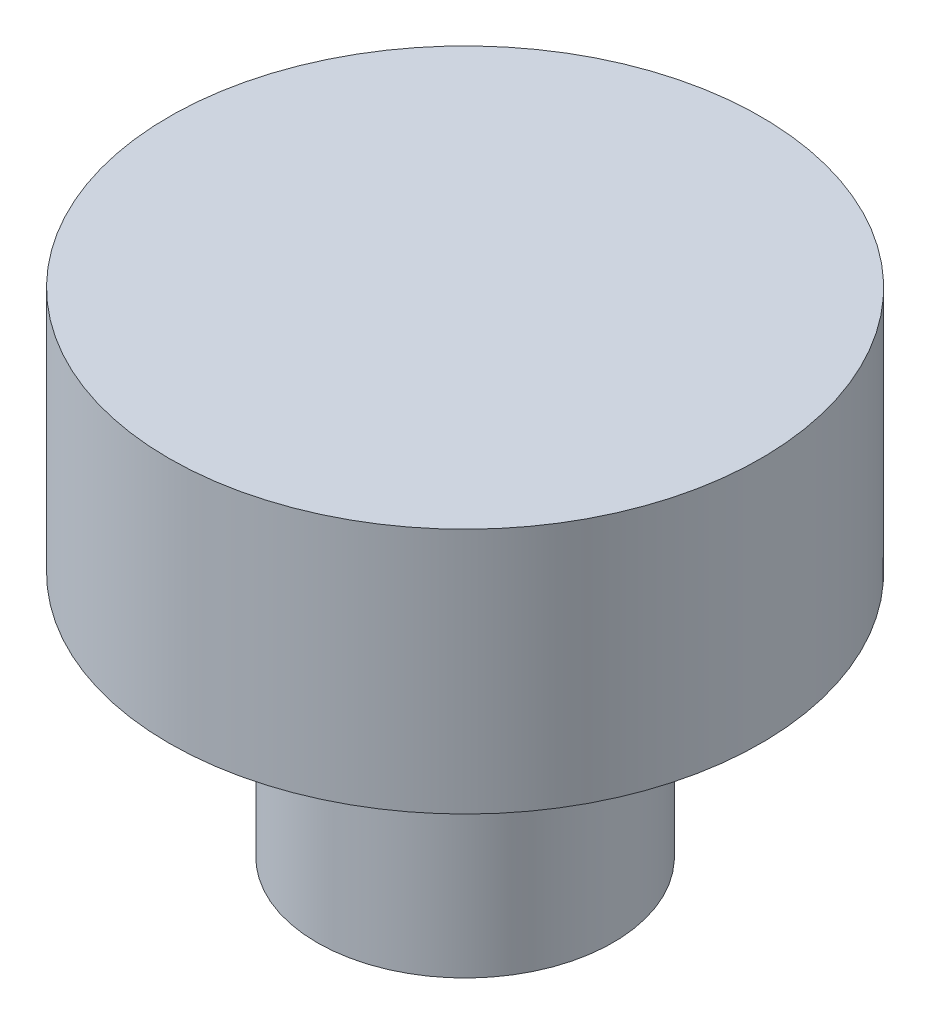
ISO-10303-21;
HEADER;
FILE_DESCRIPTION(('STEP AP214'),'2;1');
FILE_NAME('part.step','',(''),(''),'','','');
FILE_SCHEMA(('AUTOMOTIVE_DESIGN { 1 0 10303 214 1 1 1 1 }'));
ENDSEC;
DATA;
#1=APPLICATION_CONTEXT('core data for automotive mechanical design processes');
#2=APPLICATION_PROTOCOL_DEFINITION('international standard','automotive_design',2000,#1);
#3=PRODUCT_CONTEXT('',#1,'mechanical');
#4=PRODUCT('Part','Part','',(#3));
#5=PRODUCT_RELATED_PRODUCT_CATEGORY('part','',(#4));
#6=PRODUCT_DEFINITION_FORMATION('','',#4);
#7=PRODUCT_DEFINITION_CONTEXT('part definition',#1,'design');
#8=PRODUCT_DEFINITION('design','',#6,#7);
#9=PRODUCT_DEFINITION_SHAPE('','',#8);
#10=(LENGTH_UNIT() NAMED_UNIT(*) SI_UNIT(.MILLI.,.METRE.));
#11=(NAMED_UNIT(*) PLANE_ANGLE_UNIT() SI_UNIT($,.RADIAN.));
#12=(NAMED_UNIT(*) SI_UNIT($,.STERADIAN.) SOLID_ANGLE_UNIT());
#13=UNCERTAINTY_MEASURE_WITH_UNIT(LENGTH_MEASURE(1.E-05),#10,'distance_accuracy_value','');
#14=(GEOMETRIC_REPRESENTATION_CONTEXT(3) GLOBAL_UNCERTAINTY_ASSIGNED_CONTEXT((#13)) GLOBAL_UNIT_ASSIGNED_CONTEXT((#10,
#11,#12)) REPRESENTATION_CONTEXT('',''));
#15=CARTESIAN_POINT('',(0.,0.,0.));
#16=DIRECTION('',(0.,0.,1.));
#17=DIRECTION('',(1.,0.,0.));
#18=AXIS2_PLACEMENT_3D('',#15,#16,#17);
#19=CARTESIAN_POINT('',(0.,5.,0.));
#20=DIRECTION('',(0.,-1.,0.));
#21=DIRECTION('',(0.,0.,-1.));
#22=AXIS2_PLACEMENT_3D('',#19,#20,#21);
#23=CYLINDRICAL_SURFACE('',#22,6.);
#24=CARTESIAN_POINT('',(0.,5.,0.));
#25=DIRECTION('',(0.,1.,0.));
#26=DIRECTION('',(0.,0.,1.));
#27=AXIS2_PLACEMENT_3D('',#24,#25,#26);
#28=CIRCLE('',#27,6.);
#29=CARTESIAN_POINT('',(0.,5.,6.));
#30=VERTEX_POINT('',#29);
#31=EDGE_CURVE('E39',#30,#30,#28,.T.);
#32=ORIENTED_EDGE('',*,*,#31,.F.);
#33=EDGE_LOOP('',(#32));
#34=FACE_BOUND('',#33,.T.);
#35=CARTESIAN_POINT('',(0.,0.,0.));
#36=DIRECTION('',(0.,1.,0.));
#37=DIRECTION('',(0.,0.,1.));
#38=AXIS2_PLACEMENT_3D('',#35,#36,#37);
#39=CIRCLE('',#38,6.);
#40=CARTESIAN_POINT('',(0.,0.,6.));
#41=VERTEX_POINT('',#40);
#42=EDGE_CURVE('E43',#41,#41,#39,.T.);
#43=ORIENTED_EDGE('',*,*,#42,.T.);
#44=EDGE_LOOP('',(#43));
#45=FACE_BOUND('',#44,.T.);
#46=ADVANCED_FACE('F33',(#34,#45),#23,.T.);
#47=CARTESIAN_POINT('',(0.,5.,0.));
#48=DIRECTION('',(0.,1.,0.));
#49=DIRECTION('',(0.,0.,1.));
#50=AXIS2_PLACEMENT_3D('',#47,#48,#49);
#51=PLANE('',#50);
#52=ORIENTED_EDGE('',*,*,#31,.T.);
#53=EDGE_LOOP('',(#52));
#54=FACE_BOUND('',#53,.T.);
#55=ADVANCED_FACE('F64',(#54),#51,.T.);
#56=CARTESIAN_POINT('',(0.,0.,0.));
#57=DIRECTION('',(0.,1.,0.));
#58=DIRECTION('',(0.,0.,1.));
#59=AXIS2_PLACEMENT_3D('',#56,#57,#58);
#60=PLANE('',#59);
#61=CARTESIAN_POINT('',(0.,0.,0.));
#62=DIRECTION('',(0.,1.,0.));
#63=DIRECTION('',(0.,0.,1.));
#64=AXIS2_PLACEMENT_3D('',#61,#62,#63);
#65=CIRCLE('',#64,3.);
#66=CARTESIAN_POINT('',(0.,0.,3.));
#67=VERTEX_POINT('',#66);
#68=EDGE_CURVE('E10',#67,#67,#65,.F.);
#69=ORIENTED_EDGE('',*,*,#68,.F.);
#70=EDGE_LOOP('',(#69));
#71=FACE_BOUND('',#70,.T.);
#72=ORIENTED_EDGE('',*,*,#42,.F.);
#73=EDGE_LOOP('',(#72));
#74=FACE_BOUND('',#73,.T.);
#75=ADVANCED_FACE('F57',(#71,#74),#60,.F.);
#76=CARTESIAN_POINT('',(0.,-5.,0.));
#77=DIRECTION('',(0.,1.,0.));
#78=DIRECTION('',(0.,0.,1.));
#79=AXIS2_PLACEMENT_3D('',#76,#77,#78);
#80=CYLINDRICAL_SURFACE('',#79,3.);
#81=CARTESIAN_POINT('',(0.,-5.,0.));
#82=DIRECTION('',(0.,-1.,0.));
#83=DIRECTION('',(0.,0.,-1.));
#84=AXIS2_PLACEMENT_3D('',#81,#82,#83);
#85=CIRCLE('',#84,3.);
#86=CARTESIAN_POINT('',(0.,-5.,-3.));
#87=VERTEX_POINT('',#86);
#88=EDGE_CURVE('E48',#87,#87,#85,.T.);
#89=ORIENTED_EDGE('',*,*,#88,.F.);
#90=EDGE_LOOP('',(#89));
#91=FACE_BOUND('',#90,.T.);
#92=ORIENTED_EDGE('',*,*,#68,.T.);
#93=EDGE_LOOP('',(#92));
#94=FACE_BOUND('',#93,.T.);
#95=ADVANCED_FACE('F55',(#91,#94),#80,.T.);
#96=CARTESIAN_POINT('',(0.,-5.,0.));
#97=DIRECTION('',(0.,-1.,0.));
#98=DIRECTION('',(0.,0.,-1.));
#99=AXIS2_PLACEMENT_3D('',#96,#97,#98);
#100=PLANE('',#99);
#101=ORIENTED_EDGE('',*,*,#88,.T.);
#102=EDGE_LOOP('',(#101));
#103=FACE_BOUND('',#102,.T.);
#104=ADVANCED_FACE('F53',(#103),#100,.T.);
#105=CLOSED_SHELL('',(#46,#55,#75,#95,#104));
#106=MANIFOLD_SOLID_BREP('B2',#105);
#107=ADVANCED_BREP_SHAPE_REPRESENTATION('',(#18,#106),#14);
#108=SHAPE_DEFINITION_REPRESENTATION(#9,#107);
ENDSEC;
END-ISO-10303-21;
